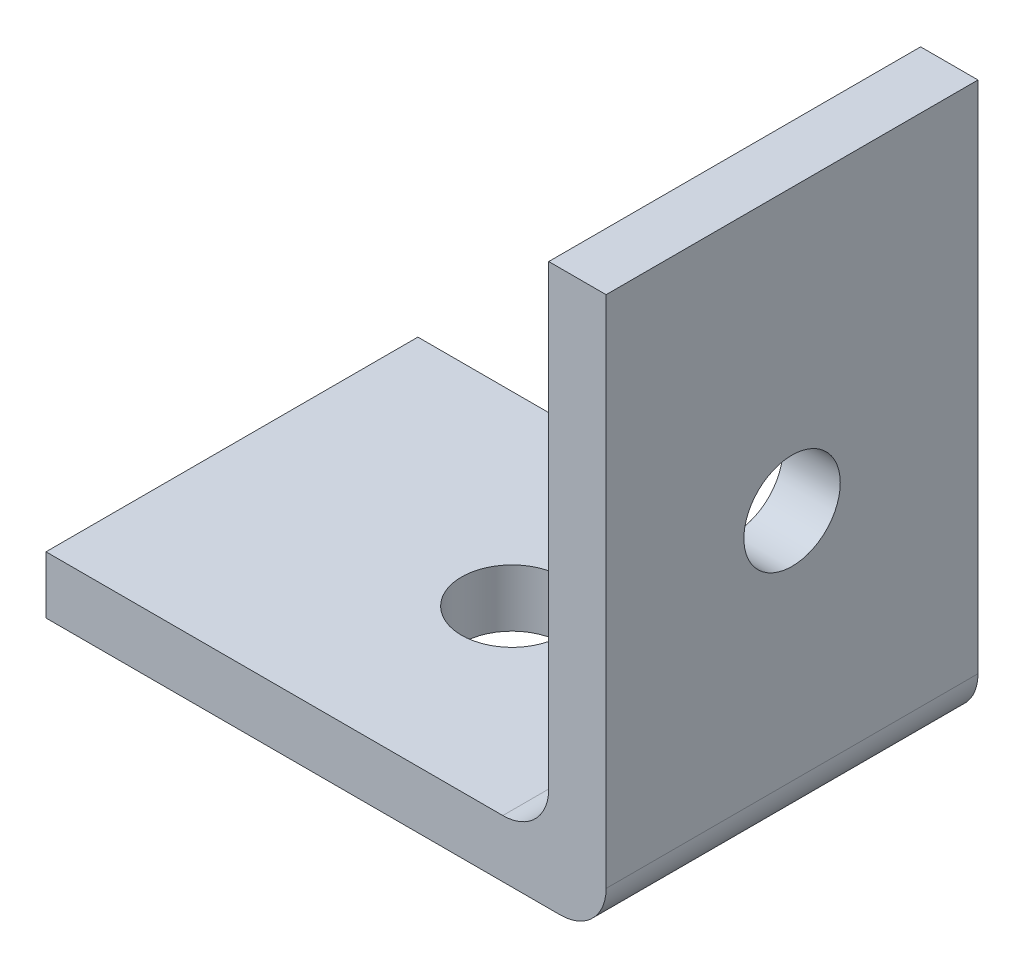
ISO-10303-21;
HEADER;
FILE_DESCRIPTION(('STEP AP214'),'2;1');
FILE_NAME('part.step','',(''),(''),'','','');
FILE_SCHEMA(('AUTOMOTIVE_DESIGN { 1 0 10303 214 1 1 1 1 }'));
ENDSEC;
DATA;
#1=APPLICATION_CONTEXT('core data for automotive mechanical design processes');
#2=APPLICATION_PROTOCOL_DEFINITION('international standard','automotive_design',2000,#1);
#3=PRODUCT_CONTEXT('',#1,'mechanical');
#4=PRODUCT('Part','Part','',(#3));
#5=PRODUCT_RELATED_PRODUCT_CATEGORY('part','',(#4));
#6=PRODUCT_DEFINITION_FORMATION('','',#4);
#7=PRODUCT_DEFINITION_CONTEXT('part definition',#1,'design');
#8=PRODUCT_DEFINITION('design','',#6,#7);
#9=PRODUCT_DEFINITION_SHAPE('','',#8);
#10=(LENGTH_UNIT() NAMED_UNIT(*) SI_UNIT(.MILLI.,.METRE.));
#11=(NAMED_UNIT(*) PLANE_ANGLE_UNIT() SI_UNIT($,.RADIAN.));
#12=(NAMED_UNIT(*) SI_UNIT($,.STERADIAN.) SOLID_ANGLE_UNIT());
#13=UNCERTAINTY_MEASURE_WITH_UNIT(LENGTH_MEASURE(1.E-05),#10,'distance_accuracy_value','');
#14=(GEOMETRIC_REPRESENTATION_CONTEXT(3) GLOBAL_UNCERTAINTY_ASSIGNED_CONTEXT((#13)) GLOBAL_UNIT_ASSIGNED_CONTEXT((#10,
#11,#12)) REPRESENTATION_CONTEXT('',''));
#15=CARTESIAN_POINT('',(0.,0.,0.));
#16=DIRECTION('',(0.,0.,1.));
#17=DIRECTION('',(1.,0.,0.));
#18=AXIS2_PLACEMENT_3D('',#15,#16,#17);
#19=CARTESIAN_POINT('',(15.494,-1.5875,20.574));
#20=DIRECTION('',(0.,1.,0.));
#21=DIRECTION('',(-1.,0.,0.));
#22=AXIS2_PLACEMENT_3D('',#19,#20,#21);
#23=PLANE('',#22);
#24=CARTESIAN_POINT('',(0.,-1.5875,10.287));
#25=DIRECTION('',(0.,-1.,0.));
#26=DIRECTION('',(1.,0.,0.));
#27=AXIS2_PLACEMENT_3D('',#24,#25,#26);
#28=CIRCLE('',#27,2.794);
#29=CARTESIAN_POINT('',(2.794,-1.5875,10.287));
#30=VERTEX_POINT('',#29);
#31=EDGE_CURVE('E175',#30,#30,#28,.T.);
#32=ORIENTED_EDGE('',*,*,#31,.F.);
#33=EDGE_LOOP('',(#32));
#34=FACE_BOUND('',#33,.T.);
#35=DIRECTION('',(1.,0.,0.));
#36=VECTOR('',#35,1.);
#37=CARTESIAN_POINT('',(15.494,-1.5875,0.));
#38=LINE('',#37,#36);
#39=CARTESIAN_POINT('',(-15.494,-1.5875,0.));
#40=VERTEX_POINT('',#39);
#41=CARTESIAN_POINT('',(12.954,-1.5875,0.));
#42=VERTEX_POINT('',#41);
#43=EDGE_CURVE('E136',#40,#42,#38,.T.);
#44=ORIENTED_EDGE('',*,*,#43,.T.);
#45=DIRECTION('',(0.,0.,-1.));
#46=VECTOR('',#45,1.);
#47=CARTESIAN_POINT('',(12.954,-1.5875,20.574));
#48=LINE('',#47,#46);
#49=CARTESIAN_POINT('',(12.954,-1.5875,20.574));
#50=VERTEX_POINT('',#49);
#51=EDGE_CURVE('E44',#42,#50,#48,.F.);
#52=ORIENTED_EDGE('',*,*,#51,.T.);
#53=DIRECTION('',(1.,0.,0.));
#54=VECTOR('',#53,1.);
#55=CARTESIAN_POINT('',(15.494,-1.5875,20.574));
#56=LINE('',#55,#54);
#57=CARTESIAN_POINT('',(-15.494,-1.5875,20.574));
#58=VERTEX_POINT('',#57);
#59=EDGE_CURVE('E112',#58,#50,#56,.T.);
#60=ORIENTED_EDGE('',*,*,#59,.F.);
#61=DIRECTION('',(0.,0.,-1.));
#62=VECTOR('',#61,1.);
#63=CARTESIAN_POINT('',(-15.494,-1.5875,20.574));
#64=LINE('',#63,#62);
#65=EDGE_CURVE('E135',#58,#40,#64,.T.);
#66=ORIENTED_EDGE('',*,*,#65,.T.);
#67=EDGE_LOOP('',(#44,#52,#60,#66));
#68=FACE_BOUND('',#67,.T.);
#69=ADVANCED_FACE('F35',(#34,#68),#23,.F.);
#70=CARTESIAN_POINT('',(15.494,-1.5875,20.574));
#71=DIRECTION('',(-1.,0.,0.));
#72=DIRECTION('',(0.,0.,1.));
#73=AXIS2_PLACEMENT_3D('',#70,#71,#72);
#74=PLANE('',#73);
#75=CARTESIAN_POINT('',(15.494,13.9065,10.287));
#76=DIRECTION('',(1.,0.,0.));
#77=DIRECTION('',(0.,0.,-1.));
#78=AXIS2_PLACEMENT_3D('',#75,#76,#77);
#79=CIRCLE('',#78,2.667);
#80=CARTESIAN_POINT('',(15.494,13.9065,7.62));
#81=VERTEX_POINT('',#80);
#82=EDGE_CURVE('E167',#81,#81,#79,.T.);
#83=ORIENTED_EDGE('',*,*,#82,.F.);
#84=EDGE_LOOP('',(#83));
#85=FACE_BOUND('',#84,.T.);
#86=DIRECTION('',(0.,1.,0.));
#87=VECTOR('',#86,1.);
#88=CARTESIAN_POINT('',(15.494,-1.5875,20.574));
#89=LINE('',#88,#87);
#90=CARTESIAN_POINT('',(15.494,0.9525,20.574));
#91=VERTEX_POINT('',#90);
#92=CARTESIAN_POINT('',(15.494,29.4005,20.574));
#93=VERTEX_POINT('',#92);
#94=EDGE_CURVE('E101',#91,#93,#89,.T.);
#95=ORIENTED_EDGE('',*,*,#94,.F.);
#96=DIRECTION('',(0.,0.,-1.));
#97=VECTOR('',#96,1.);
#98=CARTESIAN_POINT('',(15.494,0.952500000000001,20.574));
#99=LINE('',#98,#97);
#100=CARTESIAN_POINT('',(15.494,0.9525,0.));
#101=VERTEX_POINT('',#100);
#102=EDGE_CURVE('E163',#91,#101,#99,.T.);
#103=ORIENTED_EDGE('',*,*,#102,.T.);
#104=DIRECTION('',(0.,1.,0.));
#105=VECTOR('',#104,1.);
#106=CARTESIAN_POINT('',(15.494,-1.5875,0.));
#107=LINE('',#106,#105);
#108=CARTESIAN_POINT('',(15.494,29.4005,0.));
#109=VERTEX_POINT('',#108);
#110=EDGE_CURVE('E117',#101,#109,#107,.T.);
#111=ORIENTED_EDGE('',*,*,#110,.T.);
#112=DIRECTION('',(0.,0.,-1.));
#113=VECTOR('',#112,1.);
#114=CARTESIAN_POINT('',(15.494,29.4005,20.574));
#115=LINE('',#114,#113);
#116=EDGE_CURVE('E115',#93,#109,#115,.T.);
#117=ORIENTED_EDGE('',*,*,#116,.F.);
#118=EDGE_LOOP('',(#95,#103,#111,#117));
#119=FACE_BOUND('',#118,.T.);
#120=ADVANCED_FACE('F116',(#85,#119),#74,.F.);
#121=CARTESIAN_POINT('',(15.494,29.4005,20.574));
#122=DIRECTION('',(0.,-1.,0.));
#123=DIRECTION('',(1.,0.,0.));
#124=AXIS2_PLACEMENT_3D('',#121,#122,#123);
#125=PLANE('',#124);
#126=DIRECTION('',(-1.,0.,0.));
#127=VECTOR('',#126,1.);
#128=CARTESIAN_POINT('',(15.494,29.4005,0.));
#129=LINE('',#128,#127);
#130=CARTESIAN_POINT('',(12.319,29.4005,0.));
#131=VERTEX_POINT('',#130);
#132=EDGE_CURVE('E140',#109,#131,#129,.T.);
#133=ORIENTED_EDGE('',*,*,#132,.T.);
#134=DIRECTION('',(0.,0.,-1.));
#135=VECTOR('',#134,1.);
#136=CARTESIAN_POINT('',(12.319,29.4005,20.574));
#137=LINE('',#136,#135);
#138=CARTESIAN_POINT('',(12.319,29.4005,20.574));
#139=VERTEX_POINT('',#138);
#140=EDGE_CURVE('E121',#139,#131,#137,.T.);
#141=ORIENTED_EDGE('',*,*,#140,.F.);
#142=DIRECTION('',(-1.,0.,0.));
#143=VECTOR('',#142,1.);
#144=CARTESIAN_POINT('',(15.494,29.4005,20.574));
#145=LINE('',#144,#143);
#146=EDGE_CURVE('E106',#93,#139,#145,.T.);
#147=ORIENTED_EDGE('',*,*,#146,.F.);
#148=ORIENTED_EDGE('',*,*,#116,.T.);
#149=EDGE_LOOP('',(#133,#141,#147,#148));
#150=FACE_BOUND('',#149,.T.);
#151=ADVANCED_FACE('F123',(#150),#125,.F.);
#152=CARTESIAN_POINT('',(12.319,1.5875,20.574));
#153=DIRECTION('',(1.,0.,0.));
#154=DIRECTION('',(0.,0.,-1.));
#155=AXIS2_PLACEMENT_3D('',#152,#153,#154);
#156=PLANE('',#155);
#157=CARTESIAN_POINT('',(12.319,13.9065,10.287));
#158=DIRECTION('',(1.,0.,0.));
#159=DIRECTION('',(0.,0.,-1.));
#160=AXIS2_PLACEMENT_3D('',#157,#158,#159);
#161=CIRCLE('',#160,2.667);
#162=CARTESIAN_POINT('',(12.319,13.9065,7.62));
#163=VERTEX_POINT('',#162);
#164=EDGE_CURVE('E138',#163,#163,#161,.T.);
#165=ORIENTED_EDGE('',*,*,#164,.T.);
#166=EDGE_LOOP('',(#165));
#167=FACE_BOUND('',#166,.T.);
#168=DIRECTION('',(0.,-1.,0.));
#169=VECTOR('',#168,1.);
#170=CARTESIAN_POINT('',(12.319,1.5875,0.));
#171=LINE('',#170,#169);
#172=CARTESIAN_POINT('',(12.319,4.1275,0.));
#173=VERTEX_POINT('',#172);
#174=EDGE_CURVE('E142',#131,#173,#171,.T.);
#175=ORIENTED_EDGE('',*,*,#174,.T.);
#176=DIRECTION('',(0.,0.,-1.));
#177=VECTOR('',#176,1.);
#178=CARTESIAN_POINT('',(12.319,4.1275,20.574));
#179=LINE('',#178,#177);
#180=CARTESIAN_POINT('',(12.319,4.1275,20.574));
#181=VERTEX_POINT('',#180);
#182=EDGE_CURVE('E157',#173,#181,#179,.F.);
#183=ORIENTED_EDGE('',*,*,#182,.T.);
#184=DIRECTION('',(0.,-1.,0.));
#185=VECTOR('',#184,1.);
#186=CARTESIAN_POINT('',(12.319,1.5875,20.574));
#187=LINE('',#186,#185);
#188=EDGE_CURVE('E126',#139,#181,#187,.T.);
#189=ORIENTED_EDGE('',*,*,#188,.F.);
#190=ORIENTED_EDGE('',*,*,#140,.T.);
#191=EDGE_LOOP('',(#175,#183,#189,#190));
#192=FACE_BOUND('',#191,.T.);
#193=ADVANCED_FACE('F183',(#167,#192),#156,.F.);
#194=CARTESIAN_POINT('',(12.319,1.5875,20.574));
#195=DIRECTION('',(0.,-1.,0.));
#196=DIRECTION('',(1.,0.,0.));
#197=AXIS2_PLACEMENT_3D('',#194,#195,#196);
#198=PLANE('',#197);
#199=CARTESIAN_POINT('',(0.,1.5875,10.287));
#200=DIRECTION('',(0.,-1.,0.));
#201=DIRECTION('',(1.,0.,0.));
#202=AXIS2_PLACEMENT_3D('',#199,#200,#201);
#203=CIRCLE('',#202,2.794);
#204=CARTESIAN_POINT('',(2.794,1.5875,10.287));
#205=VERTEX_POINT('',#204);
#206=EDGE_CURVE('E39',#205,#205,#203,.T.);
#207=ORIENTED_EDGE('',*,*,#206,.T.);
#208=EDGE_LOOP('',(#207));
#209=FACE_BOUND('',#208,.T.);
#210=DIRECTION('',(-1.,0.,0.));
#211=VECTOR('',#210,1.);
#212=CARTESIAN_POINT('',(12.319,1.5875,20.574));
#213=LINE('',#212,#211);
#214=CARTESIAN_POINT('',(9.77900000000001,1.5875,20.574));
#215=VERTEX_POINT('',#214);
#216=CARTESIAN_POINT('',(-15.494,1.5875,20.574));
#217=VERTEX_POINT('',#216);
#218=EDGE_CURVE('E128',#215,#217,#213,.T.);
#219=ORIENTED_EDGE('',*,*,#218,.F.);
#220=DIRECTION('',(0.,0.,-1.));
#221=VECTOR('',#220,1.);
#222=CARTESIAN_POINT('',(9.77900000000001,1.5875,0.));
#223=LINE('',#222,#221);
#224=CARTESIAN_POINT('',(9.77900000000001,1.5875,0.));
#225=VERTEX_POINT('',#224);
#226=EDGE_CURVE('E120',#215,#225,#223,.T.);
#227=ORIENTED_EDGE('',*,*,#226,.T.);
#228=DIRECTION('',(-1.,0.,0.));
#229=VECTOR('',#228,1.);
#230=CARTESIAN_POINT('',(12.319,1.5875,0.));
#231=LINE('',#230,#229);
#232=CARTESIAN_POINT('',(-15.494,1.5875,0.));
#233=VERTEX_POINT('',#232);
#234=EDGE_CURVE('E145',#225,#233,#231,.T.);
#235=ORIENTED_EDGE('',*,*,#234,.T.);
#236=DIRECTION('',(0.,0.,-1.));
#237=VECTOR('',#236,1.);
#238=CARTESIAN_POINT('',(-15.494,1.5875,20.574));
#239=LINE('',#238,#237);
#240=EDGE_CURVE('E151',#217,#233,#239,.T.);
#241=ORIENTED_EDGE('',*,*,#240,.F.);
#242=EDGE_LOOP('',(#219,#227,#235,#241));
#243=FACE_BOUND('',#242,.T.);
#244=ADVANCED_FACE('F192',(#209,#243),#198,.F.);
#245=CARTESIAN_POINT('',(-15.494,1.5875,20.574));
#246=DIRECTION('',(1.,0.,0.));
#247=DIRECTION('',(0.,1.,0.));
#248=AXIS2_PLACEMENT_3D('',#245,#246,#247);
#249=PLANE('',#248);
#250=DIRECTION('',(0.,-1.,0.));
#251=VECTOR('',#250,1.);
#252=CARTESIAN_POINT('',(-15.494,1.5875,0.));
#253=LINE('',#252,#251);
#254=EDGE_CURVE('E147',#233,#40,#253,.T.);
#255=ORIENTED_EDGE('',*,*,#254,.T.);
#256=ORIENTED_EDGE('',*,*,#65,.F.);
#257=DIRECTION('',(0.,-1.,0.));
#258=VECTOR('',#257,1.);
#259=CARTESIAN_POINT('',(-15.494,1.5875,20.574));
#260=LINE('',#259,#258);
#261=EDGE_CURVE('E133',#217,#58,#260,.T.);
#262=ORIENTED_EDGE('',*,*,#261,.F.);
#263=ORIENTED_EDGE('',*,*,#240,.T.);
#264=EDGE_LOOP('',(#255,#256,#262,#263));
#265=FACE_BOUND('',#264,.T.);
#266=ADVANCED_FACE('F196',(#265),#249,.F.);
#267=CARTESIAN_POINT('',(0.,0.,20.574));
#268=DIRECTION('',(0.,0.,1.));
#269=DIRECTION('',(1.,0.,0.));
#270=AXIS2_PLACEMENT_3D('',#267,#268,#269);
#271=PLANE('',#270);
#272=ORIENTED_EDGE('',*,*,#59,.T.);
#273=CARTESIAN_POINT('',(12.954,0.952500000000001,20.574));
#274=DIRECTION('',(0.,0.,1.));
#275=DIRECTION('',(1.,0.,0.));
#276=AXIS2_PLACEMENT_3D('',#273,#274,#275);
#277=CIRCLE('',#276,2.54);
#278=EDGE_CURVE('E11',#50,#91,#277,.T.);
#279=ORIENTED_EDGE('',*,*,#278,.T.);
#280=ORIENTED_EDGE('',*,*,#94,.T.);
#281=ORIENTED_EDGE('',*,*,#146,.T.);
#282=ORIENTED_EDGE('',*,*,#188,.T.);
#283=CARTESIAN_POINT('',(9.77900000000001,4.1275,20.574));
#284=DIRECTION('',(0.,0.,1.));
#285=DIRECTION('',(1.,0.,0.));
#286=AXIS2_PLACEMENT_3D('',#283,#284,#285);
#287=CIRCLE('',#286,2.54);
#288=EDGE_CURVE('E161',#181,#215,#287,.F.);
#289=ORIENTED_EDGE('',*,*,#288,.T.);
#290=ORIENTED_EDGE('',*,*,#218,.T.);
#291=ORIENTED_EDGE('',*,*,#261,.T.);
#292=EDGE_LOOP('',(#272,#279,#280,#281,#282,#289,#290,#291));
#293=FACE_BOUND('',#292,.T.);
#294=ADVANCED_FACE('F103',(#293),#271,.T.);
#295=CARTESIAN_POINT('',(0.,0.,0.));
#296=DIRECTION('',(0.,0.,1.));
#297=DIRECTION('',(1.,0.,0.));
#298=AXIS2_PLACEMENT_3D('',#295,#296,#297);
#299=PLANE('',#298);
#300=ORIENTED_EDGE('',*,*,#110,.F.);
#301=CARTESIAN_POINT('',(12.954,0.952500000000001,0.));
#302=DIRECTION('',(0.,0.,1.));
#303=DIRECTION('',(1.,0.,0.));
#304=AXIS2_PLACEMENT_3D('',#301,#302,#303);
#305=CIRCLE('',#304,2.54);
#306=EDGE_CURVE('E59',#101,#42,#305,.F.);
#307=ORIENTED_EDGE('',*,*,#306,.T.);
#308=ORIENTED_EDGE('',*,*,#43,.F.);
#309=ORIENTED_EDGE('',*,*,#254,.F.);
#310=ORIENTED_EDGE('',*,*,#234,.F.);
#311=CARTESIAN_POINT('',(9.77900000000001,4.1275,0.));
#312=DIRECTION('',(0.,0.,1.));
#313=DIRECTION('',(1.,0.,0.));
#314=AXIS2_PLACEMENT_3D('',#311,#312,#313);
#315=CIRCLE('',#314,2.54);
#316=EDGE_CURVE('E159',#225,#173,#315,.T.);
#317=ORIENTED_EDGE('',*,*,#316,.T.);
#318=ORIENTED_EDGE('',*,*,#174,.F.);
#319=ORIENTED_EDGE('',*,*,#132,.F.);
#320=EDGE_LOOP('',(#300,#307,#308,#309,#310,#317,#318,#319));
#321=FACE_BOUND('',#320,.T.);
#322=ADVANCED_FACE('F180',(#321),#299,.F.);
#323=CARTESIAN_POINT('',(9.77900000000001,4.1275,20.574));
#324=DIRECTION('',(0.,0.,1.));
#325=DIRECTION('',(1.,0.,0.));
#326=AXIS2_PLACEMENT_3D('',#323,#324,#325);
#327=CYLINDRICAL_SURFACE('',#326,2.54);
#328=ORIENTED_EDGE('',*,*,#288,.F.);
#329=ORIENTED_EDGE('',*,*,#182,.F.);
#330=ORIENTED_EDGE('',*,*,#316,.F.);
#331=ORIENTED_EDGE('',*,*,#226,.F.);
#332=EDGE_LOOP('',(#328,#329,#330,#331));
#333=FACE_BOUND('',#332,.T.);
#334=ADVANCED_FACE('F189',(#333),#327,.F.);
#335=CARTESIAN_POINT('',(12.954,0.952500000000001,20.574));
#336=DIRECTION('',(0.,0.,-1.));
#337=DIRECTION('',(-1.,0.,0.));
#338=AXIS2_PLACEMENT_3D('',#335,#336,#337);
#339=CYLINDRICAL_SURFACE('',#338,2.54);
#340=ORIENTED_EDGE('',*,*,#278,.F.);
#341=ORIENTED_EDGE('',*,*,#51,.F.);
#342=ORIENTED_EDGE('',*,*,#306,.F.);
#343=ORIENTED_EDGE('',*,*,#102,.F.);
#344=EDGE_LOOP('',(#340,#341,#342,#343));
#345=FACE_BOUND('',#344,.T.);
#346=ADVANCED_FACE('F37',(#345),#339,.T.);
#347=CARTESIAN_POINT('',(-15.494,13.9065,10.287));
#348=DIRECTION('',(1.,0.,0.));
#349=DIRECTION('',(0.,0.,-1.));
#350=AXIS2_PLACEMENT_3D('',#347,#348,#349);
#351=CYLINDRICAL_SURFACE('',#350,2.667);
#352=ORIENTED_EDGE('',*,*,#82,.T.);
#353=EDGE_LOOP('',(#352));
#354=FACE_BOUND('',#353,.T.);
#355=ORIENTED_EDGE('',*,*,#164,.F.);
#356=EDGE_LOOP('',(#355));
#357=FACE_BOUND('',#356,.T.);
#358=ADVANCED_FACE('F212',(#354,#357),#351,.F.);
#359=CARTESIAN_POINT('',(0.,29.4005,10.287));
#360=DIRECTION('',(0.,-1.,0.));
#361=DIRECTION('',(1.,0.,0.));
#362=AXIS2_PLACEMENT_3D('',#359,#360,#361);
#363=CYLINDRICAL_SURFACE('',#362,2.794);
#364=ORIENTED_EDGE('',*,*,#31,.T.);
#365=EDGE_LOOP('',(#364));
#366=FACE_BOUND('',#365,.T.);
#367=ORIENTED_EDGE('',*,*,#206,.F.);
#368=EDGE_LOOP('',(#367));
#369=FACE_BOUND('',#368,.T.);
#370=ADVANCED_FACE('F284',(#366,#369),#363,.F.);
#371=CLOSED_SHELL('',(#69,#120,#151,#193,#244,#266,#294,#322,#334,#346,#358,#370));
#372=MANIFOLD_SOLID_BREP('B2',#371);
#373=ADVANCED_BREP_SHAPE_REPRESENTATION('',(#18,#372),#14);
#374=SHAPE_DEFINITION_REPRESENTATION(#9,#373);
ENDSEC;
END-ISO-10303-21;
